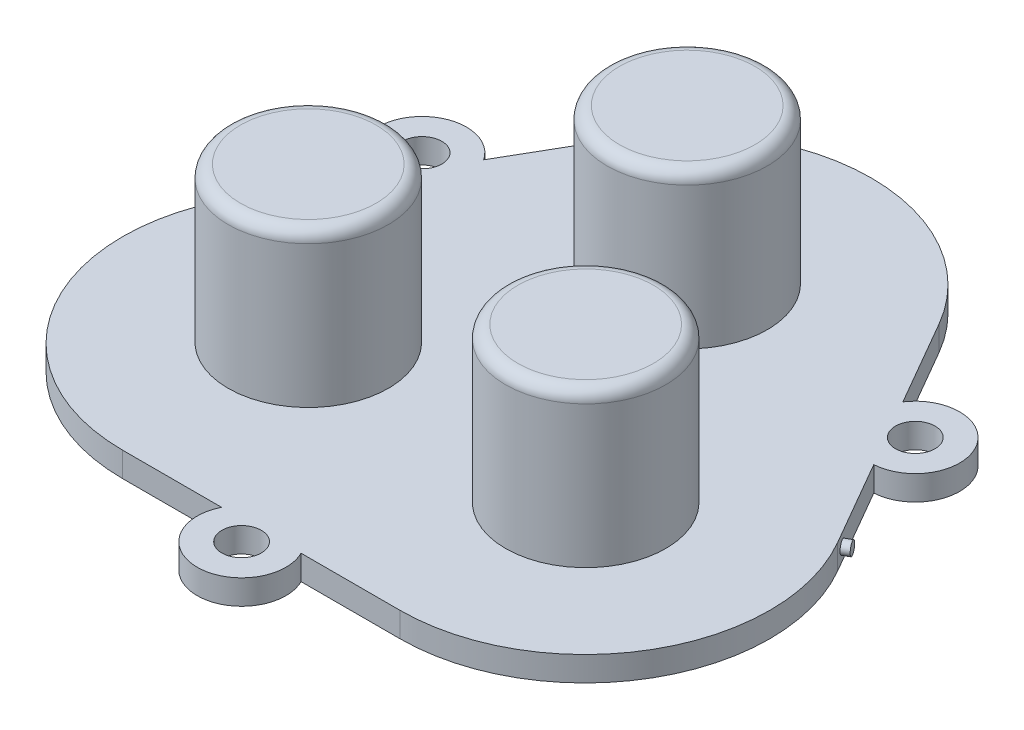
ISO-10303-21;
HEADER;
FILE_DESCRIPTION(('STEP AP214'),'2;1');
FILE_NAME('part.step','',(''),(''),'','','');
FILE_SCHEMA(('AUTOMOTIVE_DESIGN { 1 0 10303 214 1 1 1 1 }'));
ENDSEC;
DATA;
#1=APPLICATION_CONTEXT('core data for automotive mechanical design processes');
#2=APPLICATION_PROTOCOL_DEFINITION('international standard','automotive_design',2000,#1);
#3=PRODUCT_CONTEXT('',#1,'mechanical');
#4=PRODUCT('Part','Part','',(#3));
#5=PRODUCT_RELATED_PRODUCT_CATEGORY('part','',(#4));
#6=PRODUCT_DEFINITION_FORMATION('','',#4);
#7=PRODUCT_DEFINITION_CONTEXT('part definition',#1,'design');
#8=PRODUCT_DEFINITION('design','',#6,#7);
#9=PRODUCT_DEFINITION_SHAPE('','',#8);
#10=(LENGTH_UNIT() NAMED_UNIT(*) SI_UNIT(.MILLI.,.METRE.));
#11=(NAMED_UNIT(*) PLANE_ANGLE_UNIT() SI_UNIT($,.RADIAN.));
#12=(NAMED_UNIT(*) SI_UNIT($,.STERADIAN.) SOLID_ANGLE_UNIT());
#13=UNCERTAINTY_MEASURE_WITH_UNIT(LENGTH_MEASURE(1.E-05),#10,'distance_accuracy_value','');
#14=(GEOMETRIC_REPRESENTATION_CONTEXT(3) GLOBAL_UNCERTAINTY_ASSIGNED_CONTEXT((#13)) GLOBAL_UNIT_ASSIGNED_CONTEXT((#10,
#11,#12)) REPRESENTATION_CONTEXT('',''));
#15=CARTESIAN_POINT('',(0.,0.,0.));
#16=DIRECTION('',(0.,0.,1.));
#17=DIRECTION('',(1.,0.,0.));
#18=AXIS2_PLACEMENT_3D('',#15,#16,#17);
#19=CARTESIAN_POINT('',(-11.2500000511737,2.,7.14278559354404));
#20=DIRECTION('',(0.,1.,0.));
#21=DIRECTION('',(0.,0.,1.));
#22=AXIS2_PLACEMENT_3D('',#19,#20,#21);
#23=PLANE('',#22);
#24=CARTESIAN_POINT('',(-11.3100251260065,2.,7.02273544387849));
#25=DIRECTION('',(0.,1.,0.));
#26=DIRECTION('',(0.,0.,1.));
#27=AXIS2_PLACEMENT_3D('',#24,#25,#26);
#28=CIRCLE('',#27,6.5);
#29=CARTESIAN_POINT('',(-11.3100251260065,2.,13.5227354438785));
#30=VERTEX_POINT('',#29);
#31=EDGE_CURVE('E345',#30,#30,#28,.F.);
#32=ORIENTED_EDGE('',*,*,#31,.T.);
#33=EDGE_LOOP('',(#32));
#34=FACE_BOUND('',#33,.T.);
#35=CARTESIAN_POINT('',(11.1899748739934,2.,7.02273544387849));
#36=DIRECTION('',(0.,1.,0.));
#37=DIRECTION('',(0.,0.,1.));
#38=AXIS2_PLACEMENT_3D('',#35,#36,#37);
#39=CIRCLE('',#38,6.5);
#40=CARTESIAN_POINT('',(11.1899748739934,2.,13.5227354438785));
#41=VERTEX_POINT('',#40);
#42=EDGE_CURVE('E347',#41,#41,#39,.F.);
#43=ORIENTED_EDGE('',*,*,#42,.T.);
#44=EDGE_LOOP('',(#43));
#45=FACE_BOUND('',#44,.T.);
#46=CARTESIAN_POINT('',(-0.0600251260065108,2.,-12.4628361412714));
#47=DIRECTION('',(0.,1.,0.));
#48=DIRECTION('',(0.,0.,1.));
#49=AXIS2_PLACEMENT_3D('',#46,#47,#48);
#50=CIRCLE('',#49,6.5);
#51=CARTESIAN_POINT('',(-0.0600251260065108,2.,-5.96283614127141));
#52=VERTEX_POINT('',#51);
#53=EDGE_CURVE('E352',#52,#52,#50,.F.);
#54=ORIENTED_EDGE('',*,*,#53,.T.);
#55=EDGE_LOOP('',(#54));
#56=FACE_BOUND('',#55,.T.);
#57=CARTESIAN_POINT('',(-20.0010217539954,2.,-10.9000001990309));
#58=DIRECTION('',(0.,1.,0.));
#59=DIRECTION('',(0.,0.,1.));
#60=AXIS2_PLACEMENT_3D('',#57,#58,#59);
#61=CIRCLE('',#60,1.6);
#62=CARTESIAN_POINT('',(-20.0010217539954,2.,-9.30000019903093));
#63=VERTEX_POINT('',#62);
#64=EDGE_CURVE('E362',#63,#63,#61,.T.);
#65=ORIENTED_EDGE('',*,*,#64,.F.);
#66=EDGE_LOOP('',(#65));
#67=FACE_BOUND('',#66,.T.);
#68=CARTESIAN_POINT('',(-11.2500000511737,2.,7.14278559354404));
#69=DIRECTION('',(0.,1.,0.));
#70=DIRECTION('',(0.,0.,1.));
#71=AXIS2_PLACEMENT_3D('',#68,#69,#70);
#72=CIRCLE('',#71,15.);
#73=CARTESIAN_POINT('',(-24.2403811079403,2.,-0.357214406455925));
#74=VERTEX_POINT('',#73);
#75=CARTESIAN_POINT('',(-11.2500000511737,2.,22.142785593544));
#76=VERTEX_POINT('',#75);
#77=EDGE_CURVE('E186',#74,#76,#72,.T.);
#78=ORIENTED_EDGE('',*,*,#77,.T.);
#79=DIRECTION('',(1.,0.,0.));
#80=VECTOR('',#79,1.);
#81=CARTESIAN_POINT('',(-11.2500000511737,2.,22.142785593544));
#82=LINE('',#81,#80);
#83=CARTESIAN_POINT('',(-3.2249031504929,2.,22.1427855935441));
#84=VERTEX_POINT('',#83);
#85=EDGE_CURVE('E114',#76,#84,#82,.T.);
#86=ORIENTED_EDGE('',*,*,#85,.T.);
#87=CARTESIAN_POINT('',(-5.11722688081806E-08,2.,23.7427855935431));
#88=DIRECTION('',(0.,1.,0.));
#89=DIRECTION('',(0.,0.,1.));
#90=AXIS2_PLACEMENT_3D('',#87,#88,#89);
#91=CIRCLE('',#90,3.60000000000066);
#92=CARTESIAN_POINT('',(3.22490304814838,2.,22.1427855935442));
#93=VERTEX_POINT('',#92);
#94=EDGE_CURVE('E374',#84,#93,#91,.T.);
#95=ORIENTED_EDGE('',*,*,#94,.T.);
#96=DIRECTION('',(1.,0.,0.));
#97=VECTOR('',#96,1.);
#98=CARTESIAN_POINT('',(3.22490304814839,2.,22.1427855935442));
#99=LINE('',#98,#97);
#100=CARTESIAN_POINT('',(11.2499999488263,2.,22.1427855935442));
#101=VERTEX_POINT('',#100);
#102=EDGE_CURVE('E376',#93,#101,#99,.T.);
#103=ORIENTED_EDGE('',*,*,#102,.T.);
#104=CARTESIAN_POINT('',(11.2499999488264,2.,7.14278559354415));
#105=DIRECTION('',(0.,1.,0.));
#106=DIRECTION('',(0.,0.,1.));
#107=AXIS2_PLACEMENT_3D('',#104,#105,#106);
#108=CIRCLE('',#107,15.0000000000001);
#109=CARTESIAN_POINT('',(24.240381005593,2.,-0.357214406456034));
#110=VERTEX_POINT('',#109);
#111=EDGE_CURVE('E378',#101,#110,#108,.T.);
#112=ORIENTED_EDGE('',*,*,#111,.T.);
#113=DIRECTION('',(-0.500000000000005,0.,-0.866025403784436));
#114=VECTOR('',#113,1.);
#115=CARTESIAN_POINT('',(24.240381005593,2.,-0.357214406456022));
#116=LINE('',#115,#114);
#117=CARTESIAN_POINT('',(20.2278325552526,2.,-7.30715219027712));
#118=VERTEX_POINT('',#117);
#119=EDGE_CURVE('E380',#110,#118,#116,.T.);
#120=ORIENTED_EDGE('',*,*,#119,.T.);
#121=CARTESIAN_POINT('',(20.0010216516479,2.,-10.9000001990326));
#122=DIRECTION('',(0.,1.,0.));
#123=DIRECTION('',(0.,0.,1.));
#124=AXIS2_PLACEMENT_3D('',#121,#122,#123);
#125=CIRCLE('',#124,3.60000000000172);
#126=CARTESIAN_POINT('',(17.0029294559317,2.,-12.8928482077873));
#127=VERTEX_POINT('',#126);
#128=EDGE_CURVE('E382',#118,#127,#125,.T.);
#129=ORIENTED_EDGE('',*,*,#128,.T.);
#130=DIRECTION('',(-0.500000000000005,0.,-0.866025403784436));
#131=VECTOR('',#130,1.);
#132=CARTESIAN_POINT('',(17.0029294559317,2.,-12.8928482077873));
#133=LINE('',#132,#131);
#134=CARTESIAN_POINT('',(12.9903810055928,2.,-19.8427859916058));
#135=VERTEX_POINT('',#134);
#136=EDGE_CURVE('E384',#127,#135,#133,.T.);
#137=ORIENTED_EDGE('',*,*,#136,.T.);
#138=CARTESIAN_POINT('',(-5.11737398924087E-08,2.,-12.3427859916057));
#139=DIRECTION('',(0.,1.,0.));
#140=DIRECTION('',(0.,0.,1.));
#141=AXIS2_PLACEMENT_3D('',#138,#139,#140);
#142=CIRCLE('',#141,15.0000000000001);
#143=CARTESIAN_POINT('',(-12.9903811079403,2.,-19.8427859916058));
#144=VERTEX_POINT('',#143);
#145=EDGE_CURVE('E145',#135,#144,#142,.T.);
#146=ORIENTED_EDGE('',*,*,#145,.T.);
#147=DIRECTION('',(-0.499999999999998,0.,0.86602540378444));
#148=VECTOR('',#147,1.);
#149=CARTESIAN_POINT('',(-12.9903811079403,2.,-19.8427859916058));
#150=LINE('',#149,#148);
#151=CARTESIAN_POINT('',(-17.0029295582806,2.,-12.8928482077847));
#152=VERTEX_POINT('',#151);
#153=EDGE_CURVE('E139',#144,#152,#150,.T.);
#154=ORIENTED_EDGE('',*,*,#153,.T.);
#155=CARTESIAN_POINT('',(-20.0010217539954,2.,-10.9000001990309));
#156=DIRECTION('',(0.,1.,0.));
#157=DIRECTION('',(0.,0.,1.));
#158=AXIS2_PLACEMENT_3D('',#155,#156,#157);
#159=CIRCLE('',#158,3.6);
#160=CARTESIAN_POINT('',(-20.2278326576,2.,-7.30715219027715));
#161=VERTEX_POINT('',#160);
#162=EDGE_CURVE('E143',#152,#161,#159,.T.);
#163=ORIENTED_EDGE('',*,*,#162,.T.);
#164=DIRECTION('',(-0.499999999999998,0.,0.86602540378444));
#165=VECTOR('',#164,1.);
#166=CARTESIAN_POINT('',(-20.2278326576,2.,-7.30715219027714));
#167=LINE('',#166,#165);
#168=EDGE_CURVE('E58',#161,#74,#167,.T.);
#169=ORIENTED_EDGE('',*,*,#168,.T.);
#170=EDGE_LOOP('',(#78,#86,#95,#103,#112,#120,#129,#137,#146,#154,#163,#169));
#171=FACE_BOUND('',#170,.T.);
#172=CARTESIAN_POINT('',(-5.11722688081806E-08,2.,23.7427855935431));
#173=DIRECTION('',(0.,1.,0.));
#174=DIRECTION('',(0.,0.,1.));
#175=AXIS2_PLACEMENT_3D('',#172,#173,#174);
#176=CIRCLE('',#175,1.60000000000066);
#177=CARTESIAN_POINT('',(-5.11722688081806E-08,2.,25.3427855935438));
#178=VERTEX_POINT('',#177);
#179=EDGE_CURVE('E167',#178,#178,#176,.T.);
#180=ORIENTED_EDGE('',*,*,#179,.F.);
#181=EDGE_LOOP('',(#180));
#182=FACE_BOUND('',#181,.T.);
#183=CARTESIAN_POINT('',(20.0010216516479,2.,-10.9000001990326));
#184=DIRECTION('',(0.,1.,0.));
#185=DIRECTION('',(0.,0.,1.));
#186=AXIS2_PLACEMENT_3D('',#183,#184,#185);
#187=CIRCLE('',#186,1.60000000000172);
#188=CARTESIAN_POINT('',(20.0010216516479,2.,-9.30000019903091));
#189=VERTEX_POINT('',#188);
#190=EDGE_CURVE('E356',#189,#189,#187,.T.);
#191=ORIENTED_EDGE('',*,*,#190,.F.);
#192=EDGE_LOOP('',(#191));
#193=FACE_BOUND('',#192,.T.);
#194=ADVANCED_FACE('F41',(#34,#45,#56,#67,#171,#182,#193),#23,.T.);
#195=CARTESIAN_POINT('',(-11.2500000511737,0.,7.14278559354404));
#196=DIRECTION('',(0.,1.,0.));
#197=DIRECTION('',(0.,0.,1.));
#198=AXIS2_PLACEMENT_3D('',#195,#196,#197);
#199=PLANE('',#198);
#200=CARTESIAN_POINT('',(-11.2500000511737,0.,7.14278559354404));
#201=DIRECTION('',(0.,1.,0.));
#202=DIRECTION('',(0.,0.,1.));
#203=AXIS2_PLACEMENT_3D('',#200,#201,#202);
#204=CIRCLE('',#203,15.);
#205=CARTESIAN_POINT('',(-24.2403811079403,0.,-0.357214406455925));
#206=VERTEX_POINT('',#205);
#207=CARTESIAN_POINT('',(-11.2500000511737,0.,22.142785593544));
#208=VERTEX_POINT('',#207);
#209=EDGE_CURVE('E163',#206,#208,#204,.T.);
#210=ORIENTED_EDGE('',*,*,#209,.F.);
#211=DIRECTION('',(-0.499999999999998,0.,0.86602540378444));
#212=VECTOR('',#211,1.);
#213=CARTESIAN_POINT('',(-20.2278326576,0.,-7.30715219027714));
#214=LINE('',#213,#212);
#215=CARTESIAN_POINT('',(-20.2278326576,0.,-7.30715219027715));
#216=VERTEX_POINT('',#215);
#217=EDGE_CURVE('E105',#216,#206,#214,.T.);
#218=ORIENTED_EDGE('',*,*,#217,.F.);
#219=CARTESIAN_POINT('',(-20.0010217539954,0.,-10.9000001990309));
#220=DIRECTION('',(0.,1.,0.));
#221=DIRECTION('',(0.,0.,1.));
#222=AXIS2_PLACEMENT_3D('',#219,#220,#221);
#223=CIRCLE('',#222,3.6);
#224=CARTESIAN_POINT('',(-17.0029295582806,0.,-12.8928482077847));
#225=VERTEX_POINT('',#224);
#226=EDGE_CURVE('E99',#225,#216,#223,.T.);
#227=ORIENTED_EDGE('',*,*,#226,.F.);
#228=DIRECTION('',(-0.499999999999998,0.,0.86602540378444));
#229=VECTOR('',#228,1.);
#230=CARTESIAN_POINT('',(-12.9903811079403,0.,-19.8427859916058));
#231=LINE('',#230,#229);
#232=CARTESIAN_POINT('',(-12.9903811079403,0.,-19.8427859916058));
#233=VERTEX_POINT('',#232);
#234=EDGE_CURVE('E153',#233,#225,#231,.T.);
#235=ORIENTED_EDGE('',*,*,#234,.F.);
#236=CARTESIAN_POINT('',(-5.11737398924087E-08,0.,-12.3427859916057));
#237=DIRECTION('',(0.,1.,0.));
#238=DIRECTION('',(0.,0.,1.));
#239=AXIS2_PLACEMENT_3D('',#236,#237,#238);
#240=CIRCLE('',#239,15.0000000000001);
#241=CARTESIAN_POINT('',(12.9903810055928,0.,-19.8427859916058));
#242=VERTEX_POINT('',#241);
#243=EDGE_CURVE('E181',#242,#233,#240,.T.);
#244=ORIENTED_EDGE('',*,*,#243,.F.);
#245=DIRECTION('',(-0.500000000000005,0.,-0.866025403784436));
#246=VECTOR('',#245,1.);
#247=CARTESIAN_POINT('',(17.0029294559317,0.,-12.8928482077873));
#248=LINE('',#247,#246);
#249=CARTESIAN_POINT('',(17.0029294559317,0.,-12.8928482077873));
#250=VERTEX_POINT('',#249);
#251=EDGE_CURVE('E179',#250,#242,#248,.T.);
#252=ORIENTED_EDGE('',*,*,#251,.F.);
#253=CARTESIAN_POINT('',(20.0010216516479,0.,-10.9000001990326));
#254=DIRECTION('',(0.,1.,0.));
#255=DIRECTION('',(0.,0.,1.));
#256=AXIS2_PLACEMENT_3D('',#253,#254,#255);
#257=CIRCLE('',#256,3.60000000000172);
#258=CARTESIAN_POINT('',(20.2278325552526,0.,-7.30715219027712));
#259=VERTEX_POINT('',#258);
#260=EDGE_CURVE('E177',#259,#250,#257,.T.);
#261=ORIENTED_EDGE('',*,*,#260,.F.);
#262=DIRECTION('',(-0.500000000000005,0.,-0.866025403784436));
#263=VECTOR('',#262,1.);
#264=CARTESIAN_POINT('',(24.240381005593,0.,-0.357214406456022));
#265=LINE('',#264,#263);
#266=CARTESIAN_POINT('',(24.240381005593,0.,-0.357214406456034));
#267=VERTEX_POINT('',#266);
#268=EDGE_CURVE('E175',#267,#259,#265,.T.);
#269=ORIENTED_EDGE('',*,*,#268,.F.);
#270=CARTESIAN_POINT('',(11.2499999488264,0.,7.14278559354415));
#271=DIRECTION('',(0.,1.,0.));
#272=DIRECTION('',(0.,0.,1.));
#273=AXIS2_PLACEMENT_3D('',#270,#271,#272);
#274=CIRCLE('',#273,15.0000000000001);
#275=CARTESIAN_POINT('',(11.2499999488263,0.,22.1427855935442));
#276=VERTEX_POINT('',#275);
#277=EDGE_CURVE('E173',#276,#267,#274,.T.);
#278=ORIENTED_EDGE('',*,*,#277,.F.);
#279=DIRECTION('',(1.,0.,0.));
#280=VECTOR('',#279,1.);
#281=CARTESIAN_POINT('',(3.22490304814839,0.,22.1427855935442));
#282=LINE('',#281,#280);
#283=CARTESIAN_POINT('',(3.22490304814838,0.,22.1427855935442));
#284=VERTEX_POINT('',#283);
#285=EDGE_CURVE('E171',#284,#276,#282,.T.);
#286=ORIENTED_EDGE('',*,*,#285,.F.);
#287=CARTESIAN_POINT('',(-5.11722688081806E-08,0.,23.7427855935431));
#288=DIRECTION('',(0.,1.,0.));
#289=DIRECTION('',(0.,0.,1.));
#290=AXIS2_PLACEMENT_3D('',#287,#288,#289);
#291=CIRCLE('',#290,3.60000000000066);
#292=CARTESIAN_POINT('',(-3.2249031504929,0.,22.1427855935441));
#293=VERTEX_POINT('',#292);
#294=EDGE_CURVE('E169',#293,#284,#291,.T.);
#295=ORIENTED_EDGE('',*,*,#294,.F.);
#296=DIRECTION('',(1.,0.,0.));
#297=VECTOR('',#296,1.);
#298=CARTESIAN_POINT('',(-11.2500000511737,0.,22.142785593544));
#299=LINE('',#298,#297);
#300=EDGE_CURVE('E166',#208,#293,#299,.T.);
#301=ORIENTED_EDGE('',*,*,#300,.F.);
#302=EDGE_LOOP('',(#210,#218,#227,#235,#244,#252,#261,#269,#278,#286,#295,#301));
#303=FACE_BOUND('',#302,.T.);
#304=CARTESIAN_POINT('',(-5.11722688081806E-08,0.,23.7427855935431));
#305=DIRECTION('',(0.,1.,0.));
#306=DIRECTION('',(0.,0.,1.));
#307=AXIS2_PLACEMENT_3D('',#304,#305,#306);
#308=CIRCLE('',#307,1.60000000000066);
#309=CARTESIAN_POINT('',(-5.11722688081806E-08,0.,25.3427855935438));
#310=VERTEX_POINT('',#309);
#311=EDGE_CURVE('E365',#310,#310,#308,.T.);
#312=ORIENTED_EDGE('',*,*,#311,.T.);
#313=EDGE_LOOP('',(#312));
#314=FACE_BOUND('',#313,.T.);
#315=CARTESIAN_POINT('',(-20.0010217539954,0.,-10.9000001990309));
#316=DIRECTION('',(0.,1.,0.));
#317=DIRECTION('',(0.,0.,1.));
#318=AXIS2_PLACEMENT_3D('',#315,#316,#317);
#319=CIRCLE('',#318,1.6);
#320=CARTESIAN_POINT('',(-20.0010217539954,0.,-9.30000019903093));
#321=VERTEX_POINT('',#320);
#322=EDGE_CURVE('E359',#321,#321,#319,.T.);
#323=ORIENTED_EDGE('',*,*,#322,.T.);
#324=EDGE_LOOP('',(#323));
#325=FACE_BOUND('',#324,.T.);
#326=CARTESIAN_POINT('',(20.0010216516479,0.,-10.9000001990326));
#327=DIRECTION('',(0.,1.,0.));
#328=DIRECTION('',(0.,0.,1.));
#329=AXIS2_PLACEMENT_3D('',#326,#327,#328);
#330=CIRCLE('',#329,1.60000000000172);
#331=CARTESIAN_POINT('',(20.0010216516479,0.,-9.30000019903091));
#332=VERTEX_POINT('',#331);
#333=EDGE_CURVE('E355',#332,#332,#330,.T.);
#334=ORIENTED_EDGE('',*,*,#333,.T.);
#335=EDGE_LOOP('',(#334));
#336=FACE_BOUND('',#335,.T.);
#337=ADVANCED_FACE('F254',(#303,#314,#325,#336),#199,.F.);
#338=CARTESIAN_POINT('',(-11.2500000511737,2.,7.14278559354404));
#339=DIRECTION('',(0.,-1.,0.));
#340=DIRECTION('',(0.,0.,-1.));
#341=AXIS2_PLACEMENT_3D('',#338,#339,#340);
#342=CYLINDRICAL_SURFACE('',#341,15.);
#343=ORIENTED_EDGE('',*,*,#209,.T.);
#344=DIRECTION('',(0.,-1.,0.));
#345=VECTOR('',#344,1.);
#346=CARTESIAN_POINT('',(-11.2500000511737,2.,22.142785593544));
#347=LINE('',#346,#345);
#348=EDGE_CURVE('E211',#76,#208,#347,.T.);
#349=ORIENTED_EDGE('',*,*,#348,.F.);
#350=ORIENTED_EDGE('',*,*,#77,.F.);
#351=DIRECTION('',(0.,-1.,0.));
#352=VECTOR('',#351,1.);
#353=CARTESIAN_POINT('',(-24.2403811079403,2.,-0.357214406455925));
#354=LINE('',#353,#352);
#355=EDGE_CURVE('E159',#74,#206,#354,.T.);
#356=ORIENTED_EDGE('',*,*,#355,.T.);
#357=EDGE_LOOP('',(#343,#349,#350,#356));
#358=FACE_BOUND('',#357,.T.);
#359=ADVANCED_FACE('F261',(#358),#342,.T.);
#360=CARTESIAN_POINT('',(-11.2500000511737,2.,22.142785593544));
#361=DIRECTION('',(0.,0.,-1.));
#362=DIRECTION('',(-1.,0.,0.));
#363=AXIS2_PLACEMENT_3D('',#360,#361,#362);
#364=PLANE('',#363);
#365=ORIENTED_EDGE('',*,*,#300,.T.);
#366=DIRECTION('',(0.,-1.,0.));
#367=VECTOR('',#366,1.);
#368=CARTESIAN_POINT('',(-3.2249031504929,2.,22.1427855935441));
#369=LINE('',#368,#367);
#370=EDGE_CURVE('E208',#84,#293,#369,.T.);
#371=ORIENTED_EDGE('',*,*,#370,.F.);
#372=ORIENTED_EDGE('',*,*,#85,.F.);
#373=ORIENTED_EDGE('',*,*,#348,.T.);
#374=EDGE_LOOP('',(#365,#371,#372,#373));
#375=FACE_BOUND('',#374,.T.);
#376=ADVANCED_FACE('F304',(#375),#364,.F.);
#377=CARTESIAN_POINT('',(-5.11722688081806E-08,2.,23.7427855935431));
#378=DIRECTION('',(0.,-1.,0.));
#379=DIRECTION('',(0.,0.,-1.));
#380=AXIS2_PLACEMENT_3D('',#377,#378,#379);
#381=CYLINDRICAL_SURFACE('',#380,3.60000000000066);
#382=ORIENTED_EDGE('',*,*,#294,.T.);
#383=DIRECTION('',(0.,-1.,0.));
#384=VECTOR('',#383,1.);
#385=CARTESIAN_POINT('',(3.22490304814838,2.,22.1427855935442));
#386=LINE('',#385,#384);
#387=EDGE_CURVE('E205',#93,#284,#386,.T.);
#388=ORIENTED_EDGE('',*,*,#387,.F.);
#389=ORIENTED_EDGE('',*,*,#94,.F.);
#390=ORIENTED_EDGE('',*,*,#370,.T.);
#391=EDGE_LOOP('',(#382,#388,#389,#390));
#392=FACE_BOUND('',#391,.T.);
#393=ADVANCED_FACE('F300',(#392),#381,.T.);
#394=CARTESIAN_POINT('',(3.22490304814839,2.,22.1427855935442));
#395=DIRECTION('',(0.,0.,-1.));
#396=DIRECTION('',(-1.,0.,0.));
#397=AXIS2_PLACEMENT_3D('',#394,#395,#396);
#398=PLANE('',#397);
#399=ORIENTED_EDGE('',*,*,#285,.T.);
#400=DIRECTION('',(0.,-1.,0.));
#401=VECTOR('',#400,1.);
#402=CARTESIAN_POINT('',(11.2499999488263,2.,22.1427855935442));
#403=LINE('',#402,#401);
#404=EDGE_CURVE('E202',#101,#276,#403,.T.);
#405=ORIENTED_EDGE('',*,*,#404,.F.);
#406=ORIENTED_EDGE('',*,*,#102,.F.);
#407=ORIENTED_EDGE('',*,*,#387,.T.);
#408=EDGE_LOOP('',(#399,#405,#406,#407));
#409=FACE_BOUND('',#408,.T.);
#410=ADVANCED_FACE('F296',(#409),#398,.F.);
#411=CARTESIAN_POINT('',(11.2499999488264,2.,7.14278559354415));
#412=DIRECTION('',(0.,-1.,0.));
#413=DIRECTION('',(0.,0.,-1.));
#414=AXIS2_PLACEMENT_3D('',#411,#412,#413);
#415=CYLINDRICAL_SURFACE('',#414,15.0000000000001);
#416=ORIENTED_EDGE('',*,*,#277,.T.);
#417=DIRECTION('',(0.,-1.,0.));
#418=VECTOR('',#417,1.);
#419=CARTESIAN_POINT('',(24.240381005593,2.,-0.357214406456034));
#420=LINE('',#419,#418);
#421=EDGE_CURVE('E199',#110,#267,#420,.T.);
#422=ORIENTED_EDGE('',*,*,#421,.F.);
#423=ORIENTED_EDGE('',*,*,#111,.F.);
#424=ORIENTED_EDGE('',*,*,#404,.T.);
#425=EDGE_LOOP('',(#416,#422,#423,#424));
#426=FACE_BOUND('',#425,.T.);
#427=ADVANCED_FACE('F292',(#426),#415,.T.);
#428=CARTESIAN_POINT('',(24.240381005593,2.,-0.357214406456022));
#429=DIRECTION('',(-0.866025403784436,0.,0.500000000000005));
#430=DIRECTION('',(0.500000000000005,0.,0.866025403784436));
#431=AXIS2_PLACEMENT_3D('',#428,#429,#430);
#432=PLANE('',#431);
#433=CARTESIAN_POINT('',(23.7169604588047,1.,-1.26380538721872));
#434=DIRECTION('',(-0.866025403784436,0.,0.500000000000005));
#435=DIRECTION('',(0.500000000000005,0.,0.866025403784436));
#436=AXIS2_PLACEMENT_3D('',#433,#434,#435);
#437=CIRCLE('',#436,0.499999999999999);
#438=CARTESIAN_POINT('',(23.9669604588047,1.,-0.830792685326504));
#439=VERTEX_POINT('',#438);
#440=EDGE_CURVE('E11',#439,#439,#437,.F.);
#441=ORIENTED_EDGE('',*,*,#440,.F.);
#442=EDGE_LOOP('',(#441));
#443=FACE_BOUND('',#442,.T.);
#444=ORIENTED_EDGE('',*,*,#268,.T.);
#445=DIRECTION('',(0.,-1.,0.));
#446=VECTOR('',#445,1.);
#447=CARTESIAN_POINT('',(20.2278325552526,2.,-7.30715219027712));
#448=LINE('',#447,#446);
#449=EDGE_CURVE('E196',#118,#259,#448,.T.);
#450=ORIENTED_EDGE('',*,*,#449,.F.);
#451=ORIENTED_EDGE('',*,*,#119,.F.);
#452=ORIENTED_EDGE('',*,*,#421,.T.);
#453=EDGE_LOOP('',(#444,#450,#451,#452));
#454=FACE_BOUND('',#453,.T.);
#455=ADVANCED_FACE('F288',(#443,#454),#432,.F.);
#456=CARTESIAN_POINT('',(20.0010216516479,2.,-10.9000001990326));
#457=DIRECTION('',(0.,-1.,0.));
#458=DIRECTION('',(0.,0.,-1.));
#459=AXIS2_PLACEMENT_3D('',#456,#457,#458);
#460=CYLINDRICAL_SURFACE('',#459,3.60000000000172);
#461=ORIENTED_EDGE('',*,*,#260,.T.);
#462=DIRECTION('',(0.,-1.,0.));
#463=VECTOR('',#462,1.);
#464=CARTESIAN_POINT('',(17.0029294559317,2.,-12.8928482077873));
#465=LINE('',#464,#463);
#466=EDGE_CURVE('E193',#127,#250,#465,.T.);
#467=ORIENTED_EDGE('',*,*,#466,.F.);
#468=ORIENTED_EDGE('',*,*,#128,.F.);
#469=ORIENTED_EDGE('',*,*,#449,.T.);
#470=EDGE_LOOP('',(#461,#467,#468,#469));
#471=FACE_BOUND('',#470,.T.);
#472=ADVANCED_FACE('F284',(#471),#460,.T.);
#473=CARTESIAN_POINT('',(17.0029294559317,2.,-12.8928482077873));
#474=DIRECTION('',(-0.866025403784436,0.,0.500000000000005));
#475=DIRECTION('',(0.500000000000005,0.,0.866025403784436));
#476=AXIS2_PLACEMENT_3D('',#473,#474,#475);
#477=PLANE('',#476);
#478=ORIENTED_EDGE('',*,*,#251,.T.);
#479=DIRECTION('',(0.,-1.,0.));
#480=VECTOR('',#479,1.);
#481=CARTESIAN_POINT('',(12.9903810055928,2.,-19.8427859916058));
#482=LINE('',#481,#480);
#483=EDGE_CURVE('E190',#135,#242,#482,.T.);
#484=ORIENTED_EDGE('',*,*,#483,.F.);
#485=ORIENTED_EDGE('',*,*,#136,.F.);
#486=ORIENTED_EDGE('',*,*,#466,.T.);
#487=EDGE_LOOP('',(#478,#484,#485,#486));
#488=FACE_BOUND('',#487,.T.);
#489=ADVANCED_FACE('F280',(#488),#477,.F.);
#490=CARTESIAN_POINT('',(-5.11737398924087E-08,2.,-12.3427859916057));
#491=DIRECTION('',(0.,-1.,0.));
#492=DIRECTION('',(0.,0.,-1.));
#493=AXIS2_PLACEMENT_3D('',#490,#491,#492);
#494=CYLINDRICAL_SURFACE('',#493,15.0000000000001);
#495=ORIENTED_EDGE('',*,*,#243,.T.);
#496=DIRECTION('',(0.,-1.,0.));
#497=VECTOR('',#496,1.);
#498=CARTESIAN_POINT('',(-12.9903811079403,2.,-19.8427859916058));
#499=LINE('',#498,#497);
#500=EDGE_CURVE('E154',#144,#233,#499,.T.);
#501=ORIENTED_EDGE('',*,*,#500,.F.);
#502=ORIENTED_EDGE('',*,*,#145,.F.);
#503=ORIENTED_EDGE('',*,*,#483,.T.);
#504=EDGE_LOOP('',(#495,#501,#502,#503));
#505=FACE_BOUND('',#504,.T.);
#506=ADVANCED_FACE('F277',(#505),#494,.T.);
#507=CARTESIAN_POINT('',(-12.9903811079403,2.,-19.8427859916058));
#508=DIRECTION('',(0.86602540378444,0.,0.499999999999998));
#509=DIRECTION('',(0.499999999999998,0.,-0.86602540378444));
#510=AXIS2_PLACEMENT_3D('',#507,#508,#509);
#511=PLANE('',#510);
#512=ORIENTED_EDGE('',*,*,#234,.T.);
#513=DIRECTION('',(0.,-1.,0.));
#514=VECTOR('',#513,1.);
#515=CARTESIAN_POINT('',(-17.0029295582806,2.,-12.8928482077847));
#516=LINE('',#515,#514);
#517=EDGE_CURVE('E150',#152,#225,#516,.T.);
#518=ORIENTED_EDGE('',*,*,#517,.F.);
#519=ORIENTED_EDGE('',*,*,#153,.F.);
#520=ORIENTED_EDGE('',*,*,#500,.T.);
#521=EDGE_LOOP('',(#512,#518,#519,#520));
#522=FACE_BOUND('',#521,.T.);
#523=ADVANCED_FACE('F151',(#522),#511,.F.);
#524=CARTESIAN_POINT('',(-20.0010217539954,2.,-10.9000001990309));
#525=DIRECTION('',(0.,-1.,0.));
#526=DIRECTION('',(0.,0.,-1.));
#527=AXIS2_PLACEMENT_3D('',#524,#525,#526);
#528=CYLINDRICAL_SURFACE('',#527,3.6);
#529=ORIENTED_EDGE('',*,*,#226,.T.);
#530=DIRECTION('',(0.,-1.,0.));
#531=VECTOR('',#530,1.);
#532=CARTESIAN_POINT('',(-20.2278326576,2.,-7.30715219027715));
#533=LINE('',#532,#531);
#534=EDGE_CURVE('E155',#161,#216,#533,.T.);
#535=ORIENTED_EDGE('',*,*,#534,.F.);
#536=ORIENTED_EDGE('',*,*,#162,.F.);
#537=ORIENTED_EDGE('',*,*,#517,.T.);
#538=EDGE_LOOP('',(#529,#535,#536,#537));
#539=FACE_BOUND('',#538,.T.);
#540=ADVANCED_FACE('F157',(#539),#528,.T.);
#541=CARTESIAN_POINT('',(-20.2278326576,2.,-7.30715219027714));
#542=DIRECTION('',(0.86602540378444,0.,0.499999999999998));
#543=DIRECTION('',(0.499999999999998,0.,-0.86602540378444));
#544=AXIS2_PLACEMENT_3D('',#541,#542,#543);
#545=PLANE('',#544);
#546=ORIENTED_EDGE('',*,*,#217,.T.);
#547=ORIENTED_EDGE('',*,*,#355,.F.);
#548=ORIENTED_EDGE('',*,*,#168,.F.);
#549=ORIENTED_EDGE('',*,*,#534,.T.);
#550=EDGE_LOOP('',(#546,#547,#548,#549));
#551=FACE_BOUND('',#550,.T.);
#552=ADVANCED_FACE('F270',(#551),#545,.F.);
#553=CARTESIAN_POINT('',(-5.11722688081806E-08,2.,23.7427855935431));
#554=DIRECTION('',(0.,-1.,0.));
#555=DIRECTION('',(0.,0.,-1.));
#556=AXIS2_PLACEMENT_3D('',#553,#554,#555);
#557=CYLINDRICAL_SURFACE('',#556,1.60000000000066);
#558=ORIENTED_EDGE('',*,*,#179,.T.);
#559=EDGE_LOOP('',(#558));
#560=FACE_BOUND('',#559,.T.);
#561=ORIENTED_EDGE('',*,*,#311,.F.);
#562=EDGE_LOOP('',(#561));
#563=FACE_BOUND('',#562,.T.);
#564=ADVANCED_FACE('F267',(#560,#563),#557,.F.);
#565=CARTESIAN_POINT('',(-20.0010217539954,2.,-10.9000001990309));
#566=DIRECTION('',(0.,-1.,0.));
#567=DIRECTION('',(0.,0.,-1.));
#568=AXIS2_PLACEMENT_3D('',#565,#566,#567);
#569=CYLINDRICAL_SURFACE('',#568,1.6);
#570=ORIENTED_EDGE('',*,*,#64,.T.);
#571=EDGE_LOOP('',(#570));
#572=FACE_BOUND('',#571,.T.);
#573=ORIENTED_EDGE('',*,*,#322,.F.);
#574=EDGE_LOOP('',(#573));
#575=FACE_BOUND('',#574,.T.);
#576=ADVANCED_FACE('F415',(#572,#575),#569,.F.);
#577=CARTESIAN_POINT('',(20.0010216516479,2.,-10.9000001990326));
#578=DIRECTION('',(0.,-1.,0.));
#579=DIRECTION('',(0.,0.,-1.));
#580=AXIS2_PLACEMENT_3D('',#577,#578,#579);
#581=CYLINDRICAL_SURFACE('',#580,1.60000000000172);
#582=ORIENTED_EDGE('',*,*,#190,.T.);
#583=EDGE_LOOP('',(#582));
#584=FACE_BOUND('',#583,.T.);
#585=ORIENTED_EDGE('',*,*,#333,.F.);
#586=EDGE_LOOP('',(#585));
#587=FACE_BOUND('',#586,.T.);
#588=ADVANCED_FACE('F250',(#584,#587),#581,.F.);
#589=CARTESIAN_POINT('',(-0.0600251260065108,14.5,-12.4628361412714));
#590=DIRECTION('',(0.,-1.,0.));
#591=DIRECTION('',(0.,0.,-1.));
#592=AXIS2_PLACEMENT_3D('',#589,#590,#591);
#593=CYLINDRICAL_SURFACE('',#592,6.5);
#594=CARTESIAN_POINT('',(-0.0600251260065108,13.5,-12.4628361412714));
#595=DIRECTION('',(0.,1.,0.));
#596=DIRECTION('',(0.,0.,1.));
#597=AXIS2_PLACEMENT_3D('',#594,#595,#596);
#598=CIRCLE('',#597,6.5);
#599=CARTESIAN_POINT('',(-0.0600251260065108,13.5,-5.96283614127141));
#600=VERTEX_POINT('',#599);
#601=EDGE_CURVE('E50',#600,#600,#598,.F.);
#602=ORIENTED_EDGE('',*,*,#601,.T.);
#603=EDGE_LOOP('',(#602));
#604=FACE_BOUND('',#603,.T.);
#605=ORIENTED_EDGE('',*,*,#53,.F.);
#606=EDGE_LOOP('',(#605));
#607=FACE_BOUND('',#606,.T.);
#608=ADVANCED_FACE('F230',(#604,#607),#593,.T.);
#609=CARTESIAN_POINT('',(-0.0600251260065108,14.5,-12.4628361412714));
#610=DIRECTION('',(0.,1.,0.));
#611=DIRECTION('',(0.,0.,1.));
#612=AXIS2_PLACEMENT_3D('',#609,#610,#611);
#613=PLANE('',#612);
#614=CARTESIAN_POINT('',(-0.0600251260065108,14.5,-12.4628361412714));
#615=DIRECTION('',(0.,1.,0.));
#616=DIRECTION('',(0.,0.,1.));
#617=AXIS2_PLACEMENT_3D('',#614,#615,#616);
#618=CIRCLE('',#617,5.5);
#619=CARTESIAN_POINT('',(-0.0600251260065108,14.5,-6.96283614127141));
#620=VERTEX_POINT('',#619);
#621=EDGE_CURVE('E225',#620,#620,#618,.T.);
#622=ORIENTED_EDGE('',*,*,#621,.T.);
#623=EDGE_LOOP('',(#622));
#624=FACE_BOUND('',#623,.T.);
#625=ADVANCED_FACE('F239',(#624),#613,.T.);
#626=CARTESIAN_POINT('',(11.1899748739934,14.5,7.02273544387849));
#627=DIRECTION('',(0.,-1.,0.));
#628=DIRECTION('',(0.,0.,-1.));
#629=AXIS2_PLACEMENT_3D('',#626,#627,#628);
#630=CYLINDRICAL_SURFACE('',#629,6.5);
#631=CARTESIAN_POINT('',(11.1899748739934,13.5,7.02273544387849));
#632=DIRECTION('',(0.,1.,0.));
#633=DIRECTION('',(0.,0.,1.));
#634=AXIS2_PLACEMENT_3D('',#631,#632,#633);
#635=CIRCLE('',#634,6.5);
#636=CARTESIAN_POINT('',(11.1899748739934,13.5,13.5227354438785));
#637=VERTEX_POINT('',#636);
#638=EDGE_CURVE('E222',#637,#637,#635,.F.);
#639=ORIENTED_EDGE('',*,*,#638,.T.);
#640=EDGE_LOOP('',(#639));
#641=FACE_BOUND('',#640,.T.);
#642=ORIENTED_EDGE('',*,*,#42,.F.);
#643=EDGE_LOOP('',(#642));
#644=FACE_BOUND('',#643,.T.);
#645=ADVANCED_FACE('F241',(#641,#644),#630,.T.);
#646=CARTESIAN_POINT('',(11.1899748739934,14.5,7.02273544387849));
#647=DIRECTION('',(0.,1.,0.));
#648=DIRECTION('',(0.,0.,1.));
#649=AXIS2_PLACEMENT_3D('',#646,#647,#648);
#650=PLANE('',#649);
#651=CARTESIAN_POINT('',(11.1899748739934,14.5,7.02273544387849));
#652=DIRECTION('',(0.,1.,0.));
#653=DIRECTION('',(0.,0.,1.));
#654=AXIS2_PLACEMENT_3D('',#651,#652,#653);
#655=CIRCLE('',#654,5.5);
#656=CARTESIAN_POINT('',(11.1899748739934,14.5,12.5227354438785));
#657=VERTEX_POINT('',#656);
#658=EDGE_CURVE('E219',#657,#657,#655,.T.);
#659=ORIENTED_EDGE('',*,*,#658,.T.);
#660=EDGE_LOOP('',(#659));
#661=FACE_BOUND('',#660,.T.);
#662=ADVANCED_FACE('F247',(#661),#650,.T.);
#663=CARTESIAN_POINT('',(-11.3100251260065,14.5,7.02273544387849));
#664=DIRECTION('',(0.,-1.,0.));
#665=DIRECTION('',(0.,0.,-1.));
#666=AXIS2_PLACEMENT_3D('',#663,#664,#665);
#667=CYLINDRICAL_SURFACE('',#666,6.5);
#668=CARTESIAN_POINT('',(-11.3100251260065,13.5,7.02273544387849));
#669=DIRECTION('',(0.,1.,0.));
#670=DIRECTION('',(0.,0.,1.));
#671=AXIS2_PLACEMENT_3D('',#668,#669,#670);
#672=CIRCLE('',#671,6.5);
#673=CARTESIAN_POINT('',(-11.3100251260065,13.5,13.5227354438785));
#674=VERTEX_POINT('',#673);
#675=EDGE_CURVE('E216',#674,#674,#672,.F.);
#676=ORIENTED_EDGE('',*,*,#675,.T.);
#677=EDGE_LOOP('',(#676));
#678=FACE_BOUND('',#677,.T.);
#679=ORIENTED_EDGE('',*,*,#31,.F.);
#680=EDGE_LOOP('',(#679));
#681=FACE_BOUND('',#680,.T.);
#682=ADVANCED_FACE('F324',(#678,#681),#667,.T.);
#683=CARTESIAN_POINT('',(-11.3100251260065,14.5,7.02273544387849));
#684=DIRECTION('',(0.,1.,0.));
#685=DIRECTION('',(0.,0.,1.));
#686=AXIS2_PLACEMENT_3D('',#683,#684,#685);
#687=PLANE('',#686);
#688=CARTESIAN_POINT('',(-11.3100251260065,14.5,7.02273544387849));
#689=DIRECTION('',(0.,1.,0.));
#690=DIRECTION('',(0.,0.,1.));
#691=AXIS2_PLACEMENT_3D('',#688,#689,#690);
#692=CIRCLE('',#691,5.5);
#693=CARTESIAN_POINT('',(-11.3100251260065,14.5,12.5227354438785));
#694=VERTEX_POINT('',#693);
#695=EDGE_CURVE('E213',#694,#694,#692,.T.);
#696=ORIENTED_EDGE('',*,*,#695,.T.);
#697=EDGE_LOOP('',(#696));
#698=FACE_BOUND('',#697,.T.);
#699=ADVANCED_FACE('F313',(#698),#687,.T.);
#700=CARTESIAN_POINT('',(-11.3100251260065,13.5,7.02273544387849));
#701=DIRECTION('',(0.,1.,0.));
#702=DIRECTION('',(0.,0.,1.));
#703=AXIS2_PLACEMENT_3D('',#700,#701,#702);
#704=TOROIDAL_SURFACE('',#703,5.5,1.);
#705=ORIENTED_EDGE('',*,*,#675,.F.);
#706=EDGE_LOOP('',(#705));
#707=FACE_BOUND('',#706,.T.);
#708=ORIENTED_EDGE('',*,*,#695,.F.);
#709=EDGE_LOOP('',(#708));
#710=FACE_BOUND('',#709,.T.);
#711=ADVANCED_FACE('F311',(#707,#710),#704,.T.);
#712=CARTESIAN_POINT('',(11.1899748739934,13.5,7.02273544387849));
#713=DIRECTION('',(0.,1.,0.));
#714=DIRECTION('',(0.,0.,1.));
#715=AXIS2_PLACEMENT_3D('',#712,#713,#714);
#716=TOROIDAL_SURFACE('',#715,5.5,1.);
#717=ORIENTED_EDGE('',*,*,#638,.F.);
#718=EDGE_LOOP('',(#717));
#719=FACE_BOUND('',#718,.T.);
#720=ORIENTED_EDGE('',*,*,#658,.F.);
#721=EDGE_LOOP('',(#720));
#722=FACE_BOUND('',#721,.T.);
#723=ADVANCED_FACE('F236',(#719,#722),#716,.T.);
#724=CARTESIAN_POINT('',(-0.0600251260065108,13.5,-12.4628361412714));
#725=DIRECTION('',(0.,1.,0.));
#726=DIRECTION('',(0.,0.,1.));
#727=AXIS2_PLACEMENT_3D('',#724,#725,#726);
#728=TOROIDAL_SURFACE('',#727,5.5,1.);
#729=ORIENTED_EDGE('',*,*,#601,.F.);
#730=EDGE_LOOP('',(#729));
#731=FACE_BOUND('',#730,.T.);
#732=ORIENTED_EDGE('',*,*,#621,.F.);
#733=EDGE_LOOP('',(#732));
#734=FACE_BOUND('',#733,.T.);
#735=ADVANCED_FACE('F43',(#731,#734),#728,.T.);
#736=CARTESIAN_POINT('',(24.2365757010754,1.,-1.56380538721873));
#737=DIRECTION('',(-0.866025403784436,0.,0.500000000000005));
#738=DIRECTION('',(0.500000000000005,0.,0.866025403784436));
#739=AXIS2_PLACEMENT_3D('',#736,#737,#738);
#740=CYLINDRICAL_SURFACE('',#739,0.499999999999999);
#741=CARTESIAN_POINT('',(24.2365757010754,1.,-1.56380538721873));
#742=DIRECTION('',(0.866025403784436,0.,-0.500000000000005));
#743=DIRECTION('',(-0.500000000000005,0.,-0.866025403784436));
#744=AXIS2_PLACEMENT_3D('',#741,#742,#743);
#745=CIRCLE('',#744,0.499999999999999);
#746=CARTESIAN_POINT('',(23.9865757010754,1.,-1.99681808911095));
#747=VERTEX_POINT('',#746);
#748=EDGE_CURVE('E344',#747,#747,#745,.T.);
#749=ORIENTED_EDGE('',*,*,#748,.F.);
#750=EDGE_LOOP('',(#749));
#751=FACE_BOUND('',#750,.T.);
#752=ORIENTED_EDGE('',*,*,#440,.T.);
#753=EDGE_LOOP('',(#752));
#754=FACE_BOUND('',#753,.T.);
#755=ADVANCED_FACE('F235',(#751,#754),#740,.T.);
#756=CARTESIAN_POINT('',(24.2365757010754,1.,-1.56380538721873));
#757=DIRECTION('',(0.866025403784436,0.,-0.500000000000005));
#758=DIRECTION('',(-0.500000000000005,0.,-0.866025403784436));
#759=AXIS2_PLACEMENT_3D('',#756,#757,#758);
#760=PLANE('',#759);
#761=ORIENTED_EDGE('',*,*,#748,.T.);
#762=EDGE_LOOP('',(#761));
#763=FACE_BOUND('',#762,.T.);
#764=ADVANCED_FACE('F336',(#763),#760,.T.);
#765=CLOSED_SHELL('',(#194,#337,#359,#376,#393,#410,#427,#455,#472,#489,#506,#523,#540,#552,
#564,#576,#588,#608,#625,#645,#662,#682,#699,#711,#723,#735,#755,#764));
#766=MANIFOLD_SOLID_BREP('B2',#765);
#767=ADVANCED_BREP_SHAPE_REPRESENTATION('',(#18,#766),#14);
#768=SHAPE_DEFINITION_REPRESENTATION(#9,#767);
ENDSEC;
END-ISO-10303-21;
